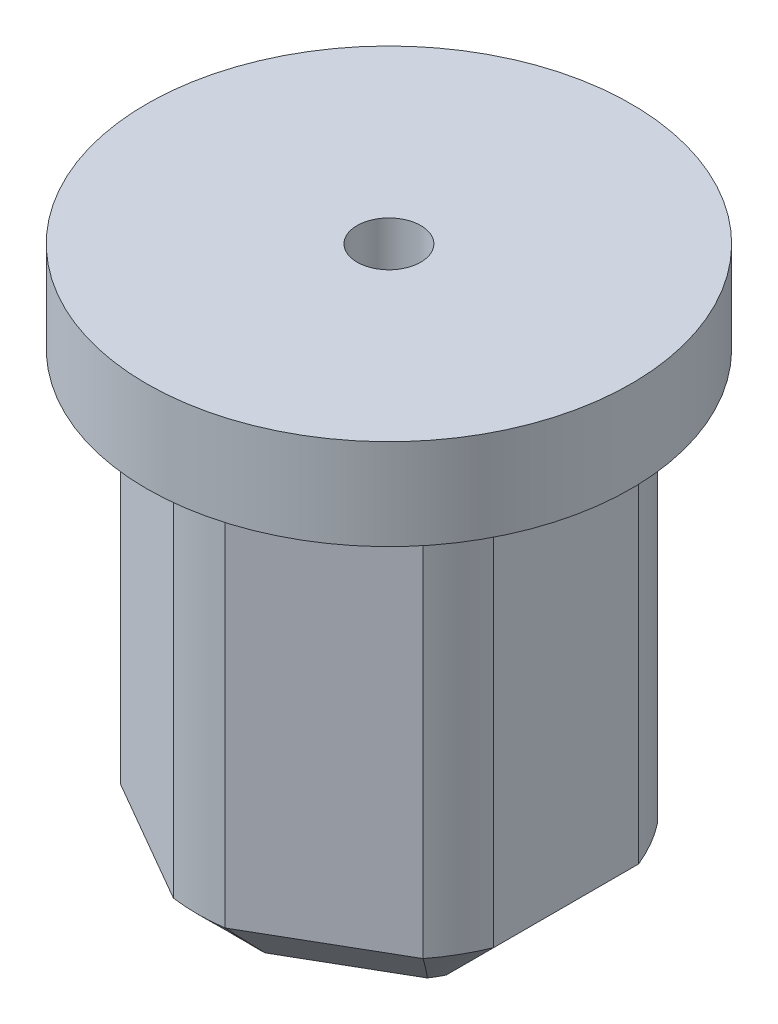
ISO-10303-21;
HEADER;
FILE_DESCRIPTION(('STEP AP214'),'2;1');
FILE_NAME('part.step','',(''),(''),'','','');
FILE_SCHEMA(('AUTOMOTIVE_DESIGN { 1 0 10303 214 1 1 1 1 }'));
ENDSEC;
DATA;
#1=APPLICATION_CONTEXT('core data for automotive mechanical design processes');
#2=APPLICATION_PROTOCOL_DEFINITION('international standard','automotive_design',2000,#1);
#3=PRODUCT_CONTEXT('',#1,'mechanical');
#4=PRODUCT('Part','Part','',(#3));
#5=PRODUCT_RELATED_PRODUCT_CATEGORY('part','',(#4));
#6=PRODUCT_DEFINITION_FORMATION('','',#4);
#7=PRODUCT_DEFINITION_CONTEXT('part definition',#1,'design');
#8=PRODUCT_DEFINITION('design','',#6,#7);
#9=PRODUCT_DEFINITION_SHAPE('','',#8);
#10=(LENGTH_UNIT() NAMED_UNIT(*) SI_UNIT(.MILLI.,.METRE.));
#11=(NAMED_UNIT(*) PLANE_ANGLE_UNIT() SI_UNIT($,.RADIAN.));
#12=(NAMED_UNIT(*) SI_UNIT($,.STERADIAN.) SOLID_ANGLE_UNIT());
#13=UNCERTAINTY_MEASURE_WITH_UNIT(LENGTH_MEASURE(1.E-05),#10,'distance_accuracy_value','');
#14=(GEOMETRIC_REPRESENTATION_CONTEXT(3) GLOBAL_UNCERTAINTY_ASSIGNED_CONTEXT((#13)) GLOBAL_UNIT_ASSIGNED_CONTEXT((#10,
#11,#12)) REPRESENTATION_CONTEXT('',''));
#15=CARTESIAN_POINT('',(0.,0.,0.));
#16=DIRECTION('',(0.,0.,1.));
#17=DIRECTION('',(1.,0.,0.));
#18=AXIS2_PLACEMENT_3D('',#15,#16,#17);
#19=CARTESIAN_POINT('',(0.,0.,0.));
#20=DIRECTION('',(0.,1.,0.));
#21=DIRECTION('',(0.,0.,1.));
#22=AXIS2_PLACEMENT_3D('',#19,#20,#21);
#23=PLANE('',#22);
#24=CARTESIAN_POINT('',(0.,0.,0.));
#25=DIRECTION('',(0.,1.,0.));
#26=DIRECTION('',(0.,0.,1.));
#27=AXIS2_PLACEMENT_3D('',#24,#25,#26);
#28=CIRCLE('',#27,8.);
#29=CARTESIAN_POINT('',(0.,0.,8.));
#30=VERTEX_POINT('',#29);
#31=EDGE_CURVE('E241',#30,#30,#28,.T.);
#32=ORIENTED_EDGE('',*,*,#31,.F.);
#33=EDGE_LOOP('',(#32));
#34=FACE_BOUND('',#33,.T.);
#35=DIRECTION('',(0.866025403784439,0.,0.5));
#36=VECTOR('',#35,1.);
#37=CARTESIAN_POINT('',(2.925,0.,-5.06624861213897));
#38=LINE('',#37,#36);
#39=CARTESIAN_POINT('',(0.853786587528944,0.,-6.26206423337829));
#40=VERTEX_POINT('',#39);
#41=CARTESIAN_POINT('',(4.99621341247106,0.,-3.87043299089964));
#42=VERTEX_POINT('',#41);
#43=EDGE_CURVE('E163',#40,#42,#38,.T.);
#44=ORIENTED_EDGE('',*,*,#43,.F.);
#45=CARTESIAN_POINT('',(0.,0.,0.));
#46=DIRECTION('',(0.,-1.,0.));
#47=DIRECTION('',(0.,0.,-1.));
#48=AXIS2_PLACEMENT_3D('',#45,#46,#47);
#49=CIRCLE('',#48,6.32);
#50=CARTESIAN_POINT('',(-0.853786587528945,0.,-6.26206423337829));
#51=VERTEX_POINT('',#50);
#52=EDGE_CURVE('E170',#51,#40,#49,.T.);
#53=ORIENTED_EDGE('',*,*,#52,.F.);
#54=DIRECTION('',(0.866025403784439,0.,-0.5));
#55=VECTOR('',#54,1.);
#56=CARTESIAN_POINT('',(-2.925,0.,-5.06624861213897));
#57=LINE('',#56,#55);
#58=CARTESIAN_POINT('',(-4.99621341247105,0.,-3.87043299089964));
#59=VERTEX_POINT('',#58);
#60=EDGE_CURVE('E184',#59,#51,#57,.T.);
#61=ORIENTED_EDGE('',*,*,#60,.F.);
#62=CARTESIAN_POINT('',(-5.85,0.,-2.39163124247866));
#63=VERTEX_POINT('',#62);
#64=EDGE_CURVE('E186',#63,#59,#49,.T.);
#65=ORIENTED_EDGE('',*,*,#64,.F.);
#66=DIRECTION('',(0.,0.,-1.));
#67=VECTOR('',#66,1.);
#68=CARTESIAN_POINT('',(-5.85,0.,0.));
#69=LINE('',#68,#67);
#70=CARTESIAN_POINT('',(-5.85,0.,2.39163124247866));
#71=VERTEX_POINT('',#70);
#72=EDGE_CURVE('E190',#71,#63,#69,.T.);
#73=ORIENTED_EDGE('',*,*,#72,.F.);
#74=CARTESIAN_POINT('',(-4.99621341247105,0.,3.87043299089964));
#75=VERTEX_POINT('',#74);
#76=EDGE_CURVE('E191',#75,#71,#49,.T.);
#77=ORIENTED_EDGE('',*,*,#76,.F.);
#78=DIRECTION('',(-0.866025403784439,0.,-0.5));
#79=VECTOR('',#78,1.);
#80=CARTESIAN_POINT('',(-2.925,0.,5.06624861213897));
#81=LINE('',#80,#79);
#82=CARTESIAN_POINT('',(-0.853786587528948,0.,6.26206423337829));
#83=VERTEX_POINT('',#82);
#84=EDGE_CURVE('E204',#83,#75,#81,.T.);
#85=ORIENTED_EDGE('',*,*,#84,.F.);
#86=CARTESIAN_POINT('',(0.853786587528945,0.,6.26206423337829));
#87=VERTEX_POINT('',#86);
#88=EDGE_CURVE('E197',#87,#83,#49,.T.);
#89=ORIENTED_EDGE('',*,*,#88,.F.);
#90=DIRECTION('',(-0.866025403784439,0.,0.5));
#91=VECTOR('',#90,1.);
#92=CARTESIAN_POINT('',(2.925,0.,5.06624861213897));
#93=LINE('',#92,#91);
#94=CARTESIAN_POINT('',(4.99621341247105,0.,3.87043299089964));
#95=VERTEX_POINT('',#94);
#96=EDGE_CURVE('E196',#95,#87,#93,.T.);
#97=ORIENTED_EDGE('',*,*,#96,.F.);
#98=CARTESIAN_POINT('',(5.85,0.,2.39163124247866));
#99=VERTEX_POINT('',#98);
#100=EDGE_CURVE('E193',#99,#95,#49,.T.);
#101=ORIENTED_EDGE('',*,*,#100,.F.);
#102=DIRECTION('',(0.,0.,1.));
#103=VECTOR('',#102,1.);
#104=CARTESIAN_POINT('',(5.85,0.,0.));
#105=LINE('',#104,#103);
#106=CARTESIAN_POINT('',(5.85,0.,-2.39163124247866));
#107=VERTEX_POINT('',#106);
#108=EDGE_CURVE('E192',#107,#99,#105,.T.);
#109=ORIENTED_EDGE('',*,*,#108,.F.);
#110=EDGE_CURVE('E179',#42,#107,#49,.T.);
#111=ORIENTED_EDGE('',*,*,#110,.F.);
#112=EDGE_LOOP('',(#44,#53,#61,#65,#73,#77,#85,#89,#97,#101,#109,#111));
#113=FACE_BOUND('',#112,.T.);
#114=ADVANCED_FACE('F33',(#34,#113),#23,.F.);
#115=CARTESIAN_POINT('',(0.,3.,0.));
#116=DIRECTION('',(0.,-1.,0.));
#117=DIRECTION('',(0.,0.,-1.));
#118=AXIS2_PLACEMENT_3D('',#115,#116,#117);
#119=CYLINDRICAL_SURFACE('',#118,8.);
#120=CARTESIAN_POINT('',(0.,3.,0.));
#121=DIRECTION('',(0.,1.,0.));
#122=DIRECTION('',(0.,0.,1.));
#123=AXIS2_PLACEMENT_3D('',#120,#121,#122);
#124=CIRCLE('',#123,8.);
#125=CARTESIAN_POINT('',(0.,3.,8.));
#126=VERTEX_POINT('',#125);
#127=EDGE_CURVE('E242',#126,#126,#124,.T.);
#128=ORIENTED_EDGE('',*,*,#127,.F.);
#129=EDGE_LOOP('',(#128));
#130=FACE_BOUND('',#129,.T.);
#131=ORIENTED_EDGE('',*,*,#31,.T.);
#132=EDGE_LOOP('',(#131));
#133=FACE_BOUND('',#132,.T.);
#134=ADVANCED_FACE('F486',(#130,#133),#119,.T.);
#135=CARTESIAN_POINT('',(0.,3.,0.));
#136=DIRECTION('',(0.,1.,0.));
#137=DIRECTION('',(0.,0.,1.));
#138=AXIS2_PLACEMENT_3D('',#135,#136,#137);
#139=PLANE('',#138);
#140=CARTESIAN_POINT('',(0.,3.,0.));
#141=DIRECTION('',(0.,1.,0.));
#142=DIRECTION('',(0.,0.,1.));
#143=AXIS2_PLACEMENT_3D('',#140,#141,#142);
#144=CIRCLE('',#143,1.04999999999999);
#145=CARTESIAN_POINT('',(0.,3.,1.04999999999999));
#146=VERTEX_POINT('',#145);
#147=EDGE_CURVE('E674',#146,#146,#144,.T.);
#148=ORIENTED_EDGE('',*,*,#147,.F.);
#149=EDGE_LOOP('',(#148));
#150=FACE_BOUND('',#149,.T.);
#151=ORIENTED_EDGE('',*,*,#127,.T.);
#152=EDGE_LOOP('',(#151));
#153=FACE_BOUND('',#152,.T.);
#154=ADVANCED_FACE('F478',(#150,#153),#139,.T.);
#155=CARTESIAN_POINT('',(2.925,-15.,-5.06624861213897));
#156=DIRECTION('',(-0.5,0.,0.866025403784439));
#157=DIRECTION('',(0.866025403784439,0.,0.5));
#158=AXIS2_PLACEMENT_3D('',#155,#156,#157);
#159=PLANE('',#158);
#160=DIRECTION('',(0.,1.,0.));
#161=VECTOR('',#160,1.);
#162=CARTESIAN_POINT('',(4.99621341247106,-15.,-3.87043299089964));
#163=LINE('',#162,#161);
#164=CARTESIAN_POINT('',(4.99621341247106,-13.,-3.87043299089964));
#165=VERTEX_POINT('',#164);
#166=EDGE_CURVE('E239',#165,#42,#163,.T.);
#167=ORIENTED_EDGE('',*,*,#166,.F.);
#168=DIRECTION('',(-0.866025403784439,0.,-0.5));
#169=VECTOR('',#168,1.);
#170=CARTESIAN_POINT('',(0.853786587528944,-13.,-6.26206423337829));
#171=LINE('',#170,#169);
#172=CARTESIAN_POINT('',(0.853786587528944,-13.,-6.26206423337829));
#173=VERTEX_POINT('',#172);
#174=EDGE_CURVE('E11',#165,#173,#171,.T.);
#175=ORIENTED_EDGE('',*,*,#174,.T.);
#176=DIRECTION('',(0.,1.,0.));
#177=VECTOR('',#176,1.);
#178=CARTESIAN_POINT('',(0.853786587528944,-15.,-6.26206423337829));
#179=LINE('',#178,#177);
#180=EDGE_CURVE('E160',#173,#40,#179,.T.);
#181=ORIENTED_EDGE('',*,*,#180,.T.);
#182=ORIENTED_EDGE('',*,*,#43,.T.);
#183=EDGE_LOOP('',(#167,#175,#181,#182));
#184=FACE_BOUND('',#183,.T.);
#185=ADVANCED_FACE('F162',(#184),#159,.F.);
#186=CARTESIAN_POINT('',(0.,-15.,0.));
#187=DIRECTION('',(0.,1.,0.));
#188=DIRECTION('',(0.,0.,1.));
#189=AXIS2_PLACEMENT_3D('',#186,#187,#188);
#190=CYLINDRICAL_SURFACE('',#189,6.32);
#191=DIRECTION('',(0.,1.,0.));
#192=VECTOR('',#191,1.);
#193=CARTESIAN_POINT('',(5.85,-15.,-2.39163124247866));
#194=LINE('',#193,#192);
#195=CARTESIAN_POINT('',(5.85,-13.,-2.39163124247866));
#196=VERTEX_POINT('',#195);
#197=EDGE_CURVE('E237',#196,#107,#194,.T.);
#198=ORIENTED_EDGE('',*,*,#197,.F.);
#199=CARTESIAN_POINT('',(0.,-13.,0.));
#200=DIRECTION('',(0.,-1.,0.));
#201=DIRECTION('',(0.,0.,-1.));
#202=AXIS2_PLACEMENT_3D('',#199,#200,#201);
#203=CIRCLE('',#202,6.32);
#204=EDGE_CURVE('E43',#196,#165,#203,.F.);
#205=ORIENTED_EDGE('',*,*,#204,.T.);
#206=ORIENTED_EDGE('',*,*,#166,.T.);
#207=ORIENTED_EDGE('',*,*,#110,.T.);
#208=EDGE_LOOP('',(#198,#205,#206,#207));
#209=FACE_BOUND('',#208,.T.);
#210=ADVANCED_FACE('F470',(#209),#190,.T.);
#211=CARTESIAN_POINT('',(5.85,-15.,0.));
#212=DIRECTION('',(-1.,0.,0.));
#213=DIRECTION('',(0.,0.,1.));
#214=AXIS2_PLACEMENT_3D('',#211,#212,#213);
#215=PLANE('',#214);
#216=DIRECTION('',(0.,1.,0.));
#217=VECTOR('',#216,1.);
#218=CARTESIAN_POINT('',(5.85,-15.,2.39163124247866));
#219=LINE('',#218,#217);
#220=CARTESIAN_POINT('',(5.85,-13.,2.39163124247866));
#221=VERTEX_POINT('',#220);
#222=EDGE_CURVE('E235',#221,#99,#219,.T.);
#223=ORIENTED_EDGE('',*,*,#222,.F.);
#224=DIRECTION('',(0.,0.,-1.));
#225=VECTOR('',#224,1.);
#226=CARTESIAN_POINT('',(5.85,-13.,-2.39163124247866));
#227=LINE('',#226,#225);
#228=EDGE_CURVE('E58',#221,#196,#227,.T.);
#229=ORIENTED_EDGE('',*,*,#228,.T.);
#230=ORIENTED_EDGE('',*,*,#197,.T.);
#231=ORIENTED_EDGE('',*,*,#108,.T.);
#232=EDGE_LOOP('',(#223,#229,#230,#231));
#233=FACE_BOUND('',#232,.T.);
#234=ADVANCED_FACE('F469',(#233),#215,.F.);
#235=DIRECTION('',(0.,1.,0.));
#236=VECTOR('',#235,1.);
#237=CARTESIAN_POINT('',(4.99621341247105,-15.,3.87043299089964));
#238=LINE('',#237,#236);
#239=CARTESIAN_POINT('',(4.99621341247105,-13.,3.87043299089964));
#240=VERTEX_POINT('',#239);
#241=EDGE_CURVE('E233',#240,#95,#238,.T.);
#242=ORIENTED_EDGE('',*,*,#241,.F.);
#243=CARTESIAN_POINT('',(0.,-13.,0.));
#244=DIRECTION('',(0.,-1.,0.));
#245=DIRECTION('',(0.,0.,-1.));
#246=AXIS2_PLACEMENT_3D('',#243,#244,#245);
#247=CIRCLE('',#246,6.32);
#248=EDGE_CURVE('E288',#240,#221,#247,.F.);
#249=ORIENTED_EDGE('',*,*,#248,.T.);
#250=ORIENTED_EDGE('',*,*,#222,.T.);
#251=ORIENTED_EDGE('',*,*,#100,.T.);
#252=EDGE_LOOP('',(#242,#249,#250,#251));
#253=FACE_BOUND('',#252,.T.);
#254=ADVANCED_FACE('F468',(#253),#190,.T.);
#255=CARTESIAN_POINT('',(2.925,-15.,5.06624861213897));
#256=DIRECTION('',(-0.5,0.,-0.866025403784439));
#257=DIRECTION('',(-0.866025403784439,0.,0.5));
#258=AXIS2_PLACEMENT_3D('',#255,#256,#257);
#259=PLANE('',#258);
#260=DIRECTION('',(0.,1.,0.));
#261=VECTOR('',#260,1.);
#262=CARTESIAN_POINT('',(0.853786587528945,-15.,6.26206423337829));
#263=LINE('',#262,#261);
#264=CARTESIAN_POINT('',(0.853786587528945,-13.,6.26206423337829));
#265=VERTEX_POINT('',#264);
#266=EDGE_CURVE('E231',#265,#87,#263,.T.);
#267=ORIENTED_EDGE('',*,*,#266,.F.);
#268=DIRECTION('',(0.866025403784439,0.,-0.5));
#269=VECTOR('',#268,1.);
#270=CARTESIAN_POINT('',(4.99621341247105,-13.,3.87043299089964));
#271=LINE('',#270,#269);
#272=EDGE_CURVE('E286',#265,#240,#271,.T.);
#273=ORIENTED_EDGE('',*,*,#272,.T.);
#274=ORIENTED_EDGE('',*,*,#241,.T.);
#275=ORIENTED_EDGE('',*,*,#96,.T.);
#276=EDGE_LOOP('',(#267,#273,#274,#275));
#277=FACE_BOUND('',#276,.T.);
#278=ADVANCED_FACE('F467',(#277),#259,.F.);
#279=DIRECTION('',(0.,1.,0.));
#280=VECTOR('',#279,1.);
#281=CARTESIAN_POINT('',(-0.853786587528948,-15.,6.26206423337829));
#282=LINE('',#281,#280);
#283=CARTESIAN_POINT('',(-0.853786587528948,-13.,6.26206423337829));
#284=VERTEX_POINT('',#283);
#285=EDGE_CURVE('E229',#284,#83,#282,.T.);
#286=ORIENTED_EDGE('',*,*,#285,.F.);
#287=CARTESIAN_POINT('',(0.,-13.,0.));
#288=DIRECTION('',(0.,-1.,0.));
#289=DIRECTION('',(0.,0.,-1.));
#290=AXIS2_PLACEMENT_3D('',#287,#288,#289);
#291=CIRCLE('',#290,6.32);
#292=EDGE_CURVE('E284',#284,#265,#291,.F.);
#293=ORIENTED_EDGE('',*,*,#292,.T.);
#294=ORIENTED_EDGE('',*,*,#266,.T.);
#295=ORIENTED_EDGE('',*,*,#88,.T.);
#296=EDGE_LOOP('',(#286,#293,#294,#295));
#297=FACE_BOUND('',#296,.T.);
#298=ADVANCED_FACE('F483',(#297),#190,.T.);
#299=CARTESIAN_POINT('',(-2.925,-15.,5.06624861213897));
#300=DIRECTION('',(0.5,0.,-0.866025403784439));
#301=DIRECTION('',(-0.866025403784439,0.,-0.5));
#302=AXIS2_PLACEMENT_3D('',#299,#300,#301);
#303=PLANE('',#302);
#304=DIRECTION('',(0.,1.,0.));
#305=VECTOR('',#304,1.);
#306=CARTESIAN_POINT('',(-4.99621341247105,-15.,3.87043299089964));
#307=LINE('',#306,#305);
#308=CARTESIAN_POINT('',(-4.99621341247105,-13.,3.87043299089964));
#309=VERTEX_POINT('',#308);
#310=EDGE_CURVE('E227',#309,#75,#307,.T.);
#311=ORIENTED_EDGE('',*,*,#310,.F.);
#312=DIRECTION('',(0.866025403784439,0.,0.5));
#313=VECTOR('',#312,1.);
#314=CARTESIAN_POINT('',(-0.853786587528949,-13.,6.26206423337829));
#315=LINE('',#314,#313);
#316=EDGE_CURVE('E282',#309,#284,#315,.T.);
#317=ORIENTED_EDGE('',*,*,#316,.T.);
#318=ORIENTED_EDGE('',*,*,#285,.T.);
#319=ORIENTED_EDGE('',*,*,#84,.T.);
#320=EDGE_LOOP('',(#311,#317,#318,#319));
#321=FACE_BOUND('',#320,.T.);
#322=ADVANCED_FACE('F462',(#321),#303,.F.);
#323=DIRECTION('',(0.,1.,0.));
#324=VECTOR('',#323,1.);
#325=CARTESIAN_POINT('',(-5.85,-15.,2.39163124247866));
#326=LINE('',#325,#324);
#327=CARTESIAN_POINT('',(-5.85,-13.,2.39163124247866));
#328=VERTEX_POINT('',#327);
#329=EDGE_CURVE('E225',#328,#71,#326,.T.);
#330=ORIENTED_EDGE('',*,*,#329,.F.);
#331=CARTESIAN_POINT('',(0.,-13.,0.));
#332=DIRECTION('',(0.,-1.,0.));
#333=DIRECTION('',(0.,0.,-1.));
#334=AXIS2_PLACEMENT_3D('',#331,#332,#333);
#335=CIRCLE('',#334,6.32);
#336=EDGE_CURVE('E280',#328,#309,#335,.F.);
#337=ORIENTED_EDGE('',*,*,#336,.T.);
#338=ORIENTED_EDGE('',*,*,#310,.T.);
#339=ORIENTED_EDGE('',*,*,#76,.T.);
#340=EDGE_LOOP('',(#330,#337,#338,#339));
#341=FACE_BOUND('',#340,.T.);
#342=ADVANCED_FACE('F460',(#341),#190,.T.);
#343=CARTESIAN_POINT('',(-5.85,-15.,0.));
#344=DIRECTION('',(1.,0.,0.));
#345=DIRECTION('',(0.,0.,-1.));
#346=AXIS2_PLACEMENT_3D('',#343,#344,#345);
#347=PLANE('',#346);
#348=DIRECTION('',(0.,1.,0.));
#349=VECTOR('',#348,1.);
#350=CARTESIAN_POINT('',(-5.85,-15.,-2.39163124247866));
#351=LINE('',#350,#349);
#352=CARTESIAN_POINT('',(-5.85,-13.,-2.39163124247866));
#353=VERTEX_POINT('',#352);
#354=EDGE_CURVE('E223',#353,#63,#351,.T.);
#355=ORIENTED_EDGE('',*,*,#354,.F.);
#356=DIRECTION('',(0.,0.,1.));
#357=VECTOR('',#356,1.);
#358=CARTESIAN_POINT('',(-5.85,-13.,2.39163124247866));
#359=LINE('',#358,#357);
#360=EDGE_CURVE('E278',#353,#328,#359,.T.);
#361=ORIENTED_EDGE('',*,*,#360,.T.);
#362=ORIENTED_EDGE('',*,*,#329,.T.);
#363=ORIENTED_EDGE('',*,*,#72,.T.);
#364=EDGE_LOOP('',(#355,#361,#362,#363));
#365=FACE_BOUND('',#364,.T.);
#366=ADVANCED_FACE('F450',(#365),#347,.F.);
#367=DIRECTION('',(0.,1.,0.));
#368=VECTOR('',#367,1.);
#369=CARTESIAN_POINT('',(-4.99621341247105,-15.,-3.87043299089964));
#370=LINE('',#369,#368);
#371=CARTESIAN_POINT('',(-4.99621341247105,-13.,-3.87043299089964));
#372=VERTEX_POINT('',#371);
#373=EDGE_CURVE('E221',#372,#59,#370,.T.);
#374=ORIENTED_EDGE('',*,*,#373,.F.);
#375=CARTESIAN_POINT('',(0.,-13.,0.));
#376=DIRECTION('',(0.,-1.,0.));
#377=DIRECTION('',(0.,0.,-1.));
#378=AXIS2_PLACEMENT_3D('',#375,#376,#377);
#379=CIRCLE('',#378,6.32);
#380=EDGE_CURVE('E276',#372,#353,#379,.F.);
#381=ORIENTED_EDGE('',*,*,#380,.T.);
#382=ORIENTED_EDGE('',*,*,#354,.T.);
#383=ORIENTED_EDGE('',*,*,#64,.T.);
#384=EDGE_LOOP('',(#374,#381,#382,#383));
#385=FACE_BOUND('',#384,.T.);
#386=ADVANCED_FACE('F447',(#385),#190,.T.);
#387=CARTESIAN_POINT('',(-2.925,-15.,-5.06624861213897));
#388=DIRECTION('',(0.5,0.,0.866025403784439));
#389=DIRECTION('',(0.866025403784439,0.,-0.5));
#390=AXIS2_PLACEMENT_3D('',#387,#388,#389);
#391=PLANE('',#390);
#392=DIRECTION('',(0.,1.,0.));
#393=VECTOR('',#392,1.);
#394=CARTESIAN_POINT('',(-0.853786587528945,-15.,-6.26206423337829));
#395=LINE('',#394,#393);
#396=CARTESIAN_POINT('',(-0.853786587528945,-13.,-6.26206423337829));
#397=VERTEX_POINT('',#396);
#398=EDGE_CURVE('E169',#397,#51,#395,.T.);
#399=ORIENTED_EDGE('',*,*,#398,.F.);
#400=DIRECTION('',(-0.866025403784439,0.,0.5));
#401=VECTOR('',#400,1.);
#402=CARTESIAN_POINT('',(-4.99621341247105,-13.,-3.87043299089964));
#403=LINE('',#402,#401);
#404=EDGE_CURVE('E274',#397,#372,#403,.T.);
#405=ORIENTED_EDGE('',*,*,#404,.T.);
#406=ORIENTED_EDGE('',*,*,#373,.T.);
#407=ORIENTED_EDGE('',*,*,#60,.T.);
#408=EDGE_LOOP('',(#399,#405,#406,#407));
#409=FACE_BOUND('',#408,.T.);
#410=ADVANCED_FACE('F443',(#409),#391,.F.);
#411=ORIENTED_EDGE('',*,*,#180,.F.);
#412=CARTESIAN_POINT('',(0.,-13.,0.));
#413=DIRECTION('',(0.,-1.,0.));
#414=DIRECTION('',(0.,0.,-1.));
#415=AXIS2_PLACEMENT_3D('',#412,#413,#414);
#416=CIRCLE('',#415,6.32);
#417=EDGE_CURVE('E272',#173,#397,#416,.F.);
#418=ORIENTED_EDGE('',*,*,#417,.T.);
#419=ORIENTED_EDGE('',*,*,#398,.T.);
#420=ORIENTED_EDGE('',*,*,#52,.T.);
#421=EDGE_LOOP('',(#411,#418,#419,#420));
#422=FACE_BOUND('',#421,.T.);
#423=ADVANCED_FACE('F182',(#422),#190,.T.);
#424=CARTESIAN_POINT('',(0.,-15.,0.));
#425=DIRECTION('',(0.,-1.,0.));
#426=DIRECTION('',(0.,0.,-1.));
#427=AXIS2_PLACEMENT_3D('',#424,#425,#426);
#428=PLANE('',#427);
#429=CARTESIAN_POINT('',(0.,-15.,0.));
#430=DIRECTION('',(0.,-1.,0.));
#431=DIRECTION('',(0.,0.,-1.));
#432=AXIS2_PLACEMENT_3D('',#429,#430,#431);
#433=CIRCLE('',#432,2.5);
#434=CARTESIAN_POINT('',(0.,-15.,-2.5));
#435=VERTEX_POINT('',#434);
#436=EDGE_CURVE('E677',#435,#435,#433,.T.);
#437=ORIENTED_EDGE('',*,*,#436,.F.);
#438=EDGE_LOOP('',(#437));
#439=FACE_BOUND('',#438,.T.);
#440=DIRECTION('',(0.866025403784439,0.,-0.5));
#441=VECTOR('',#440,1.);
#442=CARTESIAN_POINT('',(0.146213412471054,-15.,-4.53001342580942));
#443=LINE('',#442,#441);
#444=CARTESIAN_POINT('',(-3.62203417761694,-15.,-2.35441466529896));
#445=VERTEX_POINT('',#444);
#446=CARTESIAN_POINT('',(-0.227965822383059,-15.,-4.31398094384123));
#447=VERTEX_POINT('',#446);
#448=EDGE_CURVE('E267',#445,#447,#443,.T.);
#449=ORIENTED_EDGE('',*,*,#448,.T.);
#450=CARTESIAN_POINT('',(0.,-15.,0.));
#451=DIRECTION('',(0.,-1.,0.));
#452=DIRECTION('',(0.,0.,-1.));
#453=AXIS2_PLACEMENT_3D('',#450,#451,#452);
#454=CIRCLE('',#453,4.32);
#455=CARTESIAN_POINT('',(0.227965822383062,-15.,-4.31398094384123));
#456=VERTEX_POINT('',#455);
#457=EDGE_CURVE('E269',#447,#456,#454,.T.);
#458=ORIENTED_EDGE('',*,*,#457,.T.);
#459=DIRECTION('',(0.866025403784439,0.,0.5));
#460=VECTOR('',#459,1.);
#461=CARTESIAN_POINT('',(3.99621341247106,-15.,-2.13838218333076));
#462=LINE('',#461,#460);
#463=CARTESIAN_POINT('',(3.62203417761694,-15.,-2.35441466529895));
#464=VERTEX_POINT('',#463);
#465=EDGE_CURVE('E245',#456,#464,#462,.T.);
#466=ORIENTED_EDGE('',*,*,#465,.T.);
#467=CARTESIAN_POINT('',(0.,-15.,0.));
#468=DIRECTION('',(0.,-1.,0.));
#469=DIRECTION('',(0.,0.,-1.));
#470=AXIS2_PLACEMENT_3D('',#467,#468,#469);
#471=CIRCLE('',#470,4.32);
#472=CARTESIAN_POINT('',(3.85,-15.,-1.95956627854227));
#473=VERTEX_POINT('',#472);
#474=EDGE_CURVE('E249',#464,#473,#471,.T.);
#475=ORIENTED_EDGE('',*,*,#474,.T.);
#476=DIRECTION('',(0.,0.,1.));
#477=VECTOR('',#476,1.);
#478=CARTESIAN_POINT('',(3.85,-15.,2.39163124247866));
#479=LINE('',#478,#477);
#480=CARTESIAN_POINT('',(3.85,-15.,1.95956627854228));
#481=VERTEX_POINT('',#480);
#482=EDGE_CURVE('E251',#473,#481,#479,.T.);
#483=ORIENTED_EDGE('',*,*,#482,.T.);
#484=CARTESIAN_POINT('',(0.,-15.,0.));
#485=DIRECTION('',(0.,-1.,0.));
#486=DIRECTION('',(0.,0.,-1.));
#487=AXIS2_PLACEMENT_3D('',#484,#485,#486);
#488=CIRCLE('',#487,4.32);
#489=CARTESIAN_POINT('',(3.62203417761694,-15.,2.35441466529896));
#490=VERTEX_POINT('',#489);
#491=EDGE_CURVE('E253',#481,#490,#488,.T.);
#492=ORIENTED_EDGE('',*,*,#491,.T.);
#493=DIRECTION('',(-0.866025403784439,0.,0.5));
#494=VECTOR('',#493,1.);
#495=CARTESIAN_POINT('',(-0.146213412471054,-15.,4.53001342580942));
#496=LINE('',#495,#494);
#497=CARTESIAN_POINT('',(0.22796582238306,-15.,4.31398094384123));
#498=VERTEX_POINT('',#497);
#499=EDGE_CURVE('E255',#490,#498,#496,.T.);
#500=ORIENTED_EDGE('',*,*,#499,.T.);
#501=CARTESIAN_POINT('',(0.,-15.,0.));
#502=DIRECTION('',(0.,-1.,0.));
#503=DIRECTION('',(0.,0.,-1.));
#504=AXIS2_PLACEMENT_3D('',#501,#502,#503);
#505=CIRCLE('',#504,4.32);
#506=CARTESIAN_POINT('',(-0.227965822383068,-15.,4.31398094384123));
#507=VERTEX_POINT('',#506);
#508=EDGE_CURVE('E257',#498,#507,#505,.T.);
#509=ORIENTED_EDGE('',*,*,#508,.T.);
#510=DIRECTION('',(-0.866025403784439,0.,-0.5));
#511=VECTOR('',#510,1.);
#512=CARTESIAN_POINT('',(-3.99621341247106,-15.,2.13838218333077));
#513=LINE('',#512,#511);
#514=CARTESIAN_POINT('',(-3.62203417761694,-15.,2.35441466529896));
#515=VERTEX_POINT('',#514);
#516=EDGE_CURVE('E259',#507,#515,#513,.T.);
#517=ORIENTED_EDGE('',*,*,#516,.T.);
#518=CARTESIAN_POINT('',(0.,-15.,0.));
#519=DIRECTION('',(0.,-1.,0.));
#520=DIRECTION('',(0.,0.,-1.));
#521=AXIS2_PLACEMENT_3D('',#518,#519,#520);
#522=CIRCLE('',#521,4.32);
#523=CARTESIAN_POINT('',(-3.85,-15.,1.95956627854227));
#524=VERTEX_POINT('',#523);
#525=EDGE_CURVE('E261',#515,#524,#522,.T.);
#526=ORIENTED_EDGE('',*,*,#525,.T.);
#527=DIRECTION('',(0.,0.,-1.));
#528=VECTOR('',#527,1.);
#529=CARTESIAN_POINT('',(-3.85,-15.,-2.39163124247866));
#530=LINE('',#529,#528);
#531=CARTESIAN_POINT('',(-3.85,-15.,-1.95956627854227));
#532=VERTEX_POINT('',#531);
#533=EDGE_CURVE('E263',#524,#532,#530,.T.);
#534=ORIENTED_EDGE('',*,*,#533,.T.);
#535=CARTESIAN_POINT('',(0.,-15.,0.));
#536=DIRECTION('',(0.,-1.,0.));
#537=DIRECTION('',(0.,0.,-1.));
#538=AXIS2_PLACEMENT_3D('',#535,#536,#537);
#539=CIRCLE('',#538,4.32);
#540=EDGE_CURVE('E265',#532,#445,#539,.T.);
#541=ORIENTED_EDGE('',*,*,#540,.T.);
#542=EDGE_LOOP('',(#449,#458,#466,#475,#483,#492,#500,#509,#517,#526,#534,#541));
#543=FACE_BOUND('',#542,.T.);
#544=ADVANCED_FACE('F421',(#439,#543),#428,.T.);
#545=CARTESIAN_POINT('',(0.,-15.,0.));
#546=DIRECTION('',(0.,1.,0.));
#547=DIRECTION('',(0.,0.,1.));
#548=AXIS2_PLACEMENT_3D('',#545,#546,#547);
#549=CONICAL_SURFACE('',#548,4.32,0.785398163397446);
#550=CARTESIAN_POINT('',(0.853786587528945,-13.,6.26206423337829));
#551=CARTESIAN_POINT('',(0.798713202197299,-13.1670028504663,6.10102258588045));
#552=CARTESIAN_POINT('',(0.744234082561959,-13.3339427147389,5.93971056911455));
#553=CARTESIAN_POINT('',(0.636660548562186,-13.6676586538454,5.61647620337499));
#554=CARTESIAN_POINT('',(0.583566058500014,-13.8344347371514,5.45455388832261));
#555=CARTESIAN_POINT('',(0.478950596144914,-14.1678076957913,5.1300077188522));
#556=CARTESIAN_POINT('',(0.427429662528861,-14.3344045666232,4.96738384730236));
#557=CARTESIAN_POINT('',(0.326238851507311,-14.6673796797789,4.64131984685742));
#558=CARTESIAN_POINT('',(0.276569075992857,-14.8337579095834,4.47787967359145));
#559=CARTESIAN_POINT('',(0.227965822383061,-15.,4.31398094384123));
#560=B_SPLINE_CURVE_WITH_KNOTS('',3,(#550,#551,#552,#553,#554,#555,#556,#557,#558,#559),
.UNSPECIFIED.,.F.,.F.,(4,2,2,2,4),(0.,0.715344790162214,1.43065039006989,2.14597355754313,
2.86133603970507),.UNSPECIFIED.);
#561=EDGE_CURVE('E394',#265,#498,#560,.T.);
#562=ORIENTED_EDGE('',*,*,#561,.F.);
#563=ORIENTED_EDGE('',*,*,#292,.F.);
#564=CARTESIAN_POINT('',(-0.853786587528948,-13.,6.26206423337829));
#565=CARTESIAN_POINT('',(-0.798713202197304,-13.1670028504663,6.10102258588045));
#566=CARTESIAN_POINT('',(-0.744234082561965,-13.3339427147389,5.93971056911455));
#567=CARTESIAN_POINT('',(-0.636660548562192,-13.6676586538454,5.61647620337499));
#568=CARTESIAN_POINT('',(-0.583566058500019,-13.8344347371514,5.45455388832261));
#569=CARTESIAN_POINT('',(-0.478950596144919,-14.1678076957913,5.1300077188522));
#570=CARTESIAN_POINT('',(-0.427429662528865,-14.3344045666232,4.96738384730236));
#571=CARTESIAN_POINT('',(-0.326238851507315,-14.6673796797789,4.64131984685742));
#572=CARTESIAN_POINT('',(-0.276569075992861,-14.8337579095834,4.47787967359145));
#573=CARTESIAN_POINT('',(-0.227965822383066,-15.,4.31398094384123));
#574=B_SPLINE_CURVE_WITH_KNOTS('',3,(#564,#565,#566,#567,#568,#569,#570,#571,#572,#573),
.UNSPECIFIED.,.F.,.F.,(4,2,2,2,4),(0.,0.715344790162213,1.43065039006989,2.14597355754313,
2.86133603970507),.UNSPECIFIED.);
#575=EDGE_CURVE('E180',#507,#284,#574,.F.);
#576=ORIENTED_EDGE('',*,*,#575,.F.);
#577=ORIENTED_EDGE('',*,*,#508,.F.);
#578=EDGE_LOOP('',(#562,#563,#576,#577));
#579=FACE_BOUND('',#578,.T.);
#580=ADVANCED_FACE('F35',(#579),#549,.T.);
#581=CARTESIAN_POINT('',(-1.925,-15.,3.33419780457009));
#582=DIRECTION('',(-0.353553390593275,-0.707106781186546,0.612372435695796));
#583=DIRECTION('',(0.866025403784439,0.,0.5));
#584=AXIS2_PLACEMENT_3D('',#581,#582,#583);
#585=PLANE('',#584);
#586=ORIENTED_EDGE('',*,*,#575,.T.);
#587=ORIENTED_EDGE('',*,*,#316,.F.);
#588=CARTESIAN_POINT('',(-4.99621341247105,-13.,3.87043299089964));
#589=CARTESIAN_POINT('',(-4.88428394733644,-13.1670028504663,3.7422172163811));
#590=CARTESIAN_POINT('',(-4.77182320269914,-13.3339427147389,3.61438090641814));
#591=CARTESIAN_POINT('',(-4.54568079759242,-13.6676586538454,3.35960231032968));
#592=CARTESIAN_POINT('',(-4.43199920434856,-13.8344347371514,3.23265997560868));
#593=CARTESIAN_POINT('',(-4.2032417080638,-14.1678076957913,2.9797872428453));
#594=CARTESIAN_POINT('',(-4.08816577084789,-14.3344045666232,2.85385686973218));
#595=CARTESIAN_POINT('',(-3.85638146871376,-14.6673796797789,2.6031910565355));
#596=CARTESIAN_POINT('',(-3.73967301442373,-14.8337579095834,2.47845568250673));
#597=CARTESIAN_POINT('',(-3.62203417761694,-15.,2.35441466529896));
#598=B_SPLINE_CURVE_WITH_KNOTS('',3,(#588,#589,#590,#591,#592,#593,#594,#595,#596,#597),
.UNSPECIFIED.,.F.,.F.,(4,2,2,2,4),(0.,0.715344790162216,1.4306503900699,2.14597355754313,
2.86133603970507),.UNSPECIFIED.);
#599=EDGE_CURVE('E388',#515,#309,#598,.F.);
#600=ORIENTED_EDGE('',*,*,#599,.F.);
#601=ORIENTED_EDGE('',*,*,#516,.F.);
#602=EDGE_LOOP('',(#586,#587,#600,#601));
#603=FACE_BOUND('',#602,.T.);
#604=ADVANCED_FACE('F398',(#603),#585,.T.);
#605=CARTESIAN_POINT('',(1.925,-15.,3.33419780457009));
#606=DIRECTION('',(0.353553390593274,-0.707106781186546,0.612372435695796));
#607=DIRECTION('',(0.866025403784439,0.,-0.5));
#608=AXIS2_PLACEMENT_3D('',#605,#606,#607);
#609=PLANE('',#608);
#610=ORIENTED_EDGE('',*,*,#561,.T.);
#611=ORIENTED_EDGE('',*,*,#499,.F.);
#612=CARTESIAN_POINT('',(4.99621341247105,-13.,3.87043299089964));
#613=CARTESIAN_POINT('',(4.88428394733644,-13.1670028504663,3.74221721638111));
#614=CARTESIAN_POINT('',(4.77182320269914,-13.3339427147389,3.61438090641814));
#615=CARTESIAN_POINT('',(4.54568079759242,-13.6676586538454,3.35960231032968));
#616=CARTESIAN_POINT('',(4.43199920434856,-13.8344347371514,3.23265997560867));
#617=CARTESIAN_POINT('',(4.20324170806381,-14.1678076957913,2.9797872428453));
#618=CARTESIAN_POINT('',(4.08816577084789,-14.3344045666232,2.85385686973218));
#619=CARTESIAN_POINT('',(3.85638146871377,-14.6673796797789,2.6031910565355));
#620=CARTESIAN_POINT('',(3.73967301442373,-14.8337579095834,2.47845568250673));
#621=CARTESIAN_POINT('',(3.62203417761694,-15.,2.35441466529896));
#622=B_SPLINE_CURVE_WITH_KNOTS('',3,(#612,#613,#614,#615,#616,#617,#618,#619,#620,#621),
.UNSPECIFIED.,.F.,.F.,(4,2,2,2,4),(0.,0.715344790162214,1.43065039006989,2.14597355754313,
2.86133603970507),.UNSPECIFIED.);
#623=EDGE_CURVE('E375',#240,#490,#622,.T.);
#624=ORIENTED_EDGE('',*,*,#623,.F.);
#625=ORIENTED_EDGE('',*,*,#272,.F.);
#626=EDGE_LOOP('',(#610,#611,#624,#625));
#627=FACE_BOUND('',#626,.T.);
#628=ADVANCED_FACE('F384',(#627),#609,.T.);
#629=CARTESIAN_POINT('',(0.,-15.,0.));
#630=DIRECTION('',(0.,1.,0.));
#631=DIRECTION('',(0.,0.,1.));
#632=AXIS2_PLACEMENT_3D('',#629,#630,#631);
#633=CONICAL_SURFACE('',#632,4.32,0.785398163397446);
#634=ORIENTED_EDGE('',*,*,#599,.T.);
#635=ORIENTED_EDGE('',*,*,#336,.F.);
#636=CARTESIAN_POINT('',(-5.85,-13.,2.39163124247866));
#637=CARTESIAN_POINT('',(-5.68299714953374,-13.1670028504663,2.35880536949935));
#638=CARTESIAN_POINT('',(-5.51605728526111,-13.3339427147389,2.32532966269641));
#639=CARTESIAN_POINT('',(-5.1823413461546,-13.6676586538454,2.2568738930453));
#640=CARTESIAN_POINT('',(-5.01556526284858,-13.8344347371514,2.22189391271394));
#641=CARTESIAN_POINT('',(-4.68219230420872,-14.1678076957913,2.15022047600691));
#642=CARTESIAN_POINT('',(-4.51559543337675,-14.3344045666232,2.11352697757018));
#643=CARTESIAN_POINT('',(-4.18262032022108,-14.6673796797789,2.03812879032192));
#644=CARTESIAN_POINT('',(-4.01624209041659,-14.8337579095834,1.99942399108472));
#645=CARTESIAN_POINT('',(-3.85,-15.,1.95956627854227));
#646=B_SPLINE_CURVE_WITH_KNOTS('',3,(#636,#637,#638,#639,#640,#641,#642,#643,#644,#645),
.UNSPECIFIED.,.F.,.F.,(4,2,2,2,4),(0.,0.715344790162214,1.43065039006989,2.14597355754313,
2.86133603970507),.UNSPECIFIED.);
#647=EDGE_CURVE('E369',#524,#328,#646,.F.);
#648=ORIENTED_EDGE('',*,*,#647,.F.);
#649=ORIENTED_EDGE('',*,*,#525,.F.);
#650=EDGE_LOOP('',(#634,#635,#648,#649));
#651=FACE_BOUND('',#650,.T.);
#652=ADVANCED_FACE('F381',(#651),#633,.T.);
#653=CARTESIAN_POINT('',(0.,-15.,0.));
#654=DIRECTION('',(0.,1.,0.));
#655=DIRECTION('',(0.,0.,1.));
#656=AXIS2_PLACEMENT_3D('',#653,#654,#655);
#657=CONICAL_SURFACE('',#656,4.32,0.785398163397446);
#658=ORIENTED_EDGE('',*,*,#623,.T.);
#659=ORIENTED_EDGE('',*,*,#491,.F.);
#660=CARTESIAN_POINT('',(5.85,-13.,2.39163124247866));
#661=CARTESIAN_POINT('',(5.68299714953374,-13.1670028504663,2.35880536949936));
#662=CARTESIAN_POINT('',(5.5160572852611,-13.3339427147389,2.32532966269642));
#663=CARTESIAN_POINT('',(5.1823413461546,-13.6676586538454,2.25687389304531));
#664=CARTESIAN_POINT('',(5.01556526284857,-13.8344347371514,2.22189391271394));
#665=CARTESIAN_POINT('',(4.68219230420872,-14.1678076957913,2.15022047600691));
#666=CARTESIAN_POINT('',(4.51559543337675,-14.3344045666232,2.11352697757018));
#667=CARTESIAN_POINT('',(4.18262032022107,-14.6673796797789,2.03812879032193));
#668=CARTESIAN_POINT('',(4.01624209041659,-14.8337579095834,1.99942399108473));
#669=CARTESIAN_POINT('',(3.85,-15.,1.95956627854228));
#670=B_SPLINE_CURVE_WITH_KNOTS('',3,(#660,#661,#662,#663,#664,#665,#666,#667,#668,#669),
.UNSPECIFIED.,.F.,.F.,(4,2,2,2,4),(0.,0.715344790162214,1.43065039006989,2.14597355754313,
2.86133603970507),.UNSPECIFIED.);
#671=EDGE_CURVE('E355',#221,#481,#670,.T.);
#672=ORIENTED_EDGE('',*,*,#671,.F.);
#673=ORIENTED_EDGE('',*,*,#248,.F.);
#674=EDGE_LOOP('',(#658,#659,#672,#673));
#675=FACE_BOUND('',#674,.T.);
#676=ADVANCED_FACE('F364',(#675),#657,.T.);
#677=CARTESIAN_POINT('',(-3.85,-15.,0.));
#678=DIRECTION('',(-0.707106781186549,-0.707106781186546,0.));
#679=DIRECTION('',(0.,0.,1.));
#680=AXIS2_PLACEMENT_3D('',#677,#678,#679);
#681=PLANE('',#680);
#682=ORIENTED_EDGE('',*,*,#647,.T.);
#683=ORIENTED_EDGE('',*,*,#360,.F.);
#684=CARTESIAN_POINT('',(-5.85,-13.,-2.39163124247866));
#685=CARTESIAN_POINT('',(-5.68299714953374,-13.1670028504663,-2.35880536949935));
#686=CARTESIAN_POINT('',(-5.5160572852611,-13.3339427147389,-2.32532966269642));
#687=CARTESIAN_POINT('',(-5.1823413461546,-13.6676586538454,-2.25687389304531));
#688=CARTESIAN_POINT('',(-5.01556526284857,-13.8344347371514,-2.22189391271394));
#689=CARTESIAN_POINT('',(-4.68219230420872,-14.1678076957913,-2.15022047600691));
#690=CARTESIAN_POINT('',(-4.51559543337675,-14.3344045666232,-2.11352697757018));
#691=CARTESIAN_POINT('',(-4.18262032022108,-14.6673796797789,-2.03812879032192));
#692=CARTESIAN_POINT('',(-4.01624209041659,-14.8337579095834,-1.99942399108472));
#693=CARTESIAN_POINT('',(-3.85,-15.,-1.95956627854227));
#694=B_SPLINE_CURVE_WITH_KNOTS('',3,(#684,#685,#686,#687,#688,#689,#690,#691,#692,#693),
.UNSPECIFIED.,.F.,.F.,(4,2,2,2,4),(0.,0.715344790162217,1.4306503900699,2.14597355754313,
2.86133603970507),.UNSPECIFIED.);
#695=EDGE_CURVE('E349',#532,#353,#694,.F.);
#696=ORIENTED_EDGE('',*,*,#695,.F.);
#697=ORIENTED_EDGE('',*,*,#533,.F.);
#698=EDGE_LOOP('',(#682,#683,#696,#697));
#699=FACE_BOUND('',#698,.T.);
#700=ADVANCED_FACE('F361',(#699),#681,.T.);
#701=CARTESIAN_POINT('',(3.85,-15.,0.));
#702=DIRECTION('',(0.707106781186549,-0.707106781186546,0.));
#703=DIRECTION('',(0.,0.,-1.));
#704=AXIS2_PLACEMENT_3D('',#701,#702,#703);
#705=PLANE('',#704);
#706=ORIENTED_EDGE('',*,*,#671,.T.);
#707=ORIENTED_EDGE('',*,*,#482,.F.);
#708=CARTESIAN_POINT('',(5.85,-13.,-2.39163124247866));
#709=CARTESIAN_POINT('',(5.68299714953374,-13.1670028504663,-2.35880536949935));
#710=CARTESIAN_POINT('',(5.5160572852611,-13.3339427147389,-2.32532966269642));
#711=CARTESIAN_POINT('',(5.1823413461546,-13.6676586538454,-2.25687389304531));
#712=CARTESIAN_POINT('',(5.01556526284857,-13.8344347371514,-2.22189391271394));
#713=CARTESIAN_POINT('',(4.68219230420872,-14.1678076957913,-2.15022047600691));
#714=CARTESIAN_POINT('',(4.51559543337675,-14.3344045666232,-2.11352697757018));
#715=CARTESIAN_POINT('',(4.18262032022108,-14.6673796797789,-2.03812879032192));
#716=CARTESIAN_POINT('',(4.01624209041659,-14.8337579095834,-1.99942399108472));
#717=CARTESIAN_POINT('',(3.85,-15.,-1.95956627854228));
#718=B_SPLINE_CURVE_WITH_KNOTS('',3,(#708,#709,#710,#711,#712,#713,#714,#715,#716,#717),
.UNSPECIFIED.,.F.,.F.,(4,2,2,2,4),(0.,0.715344790162214,1.43065039006989,2.14597355754313,
2.86133603970507),.UNSPECIFIED.);
#719=EDGE_CURVE('E331',#196,#473,#718,.T.);
#720=ORIENTED_EDGE('',*,*,#719,.F.);
#721=ORIENTED_EDGE('',*,*,#228,.F.);
#722=EDGE_LOOP('',(#706,#707,#720,#721));
#723=FACE_BOUND('',#722,.T.);
#724=ADVANCED_FACE('F344',(#723),#705,.T.);
#725=CARTESIAN_POINT('',(0.,-15.,0.));
#726=DIRECTION('',(0.,1.,0.));
#727=DIRECTION('',(0.,0.,1.));
#728=AXIS2_PLACEMENT_3D('',#725,#726,#727);
#729=CONICAL_SURFACE('',#728,4.32,0.785398163397446);
#730=ORIENTED_EDGE('',*,*,#695,.T.);
#731=ORIENTED_EDGE('',*,*,#380,.F.);
#732=CARTESIAN_POINT('',(-4.99621341247105,-13.,-3.87043299089964));
#733=CARTESIAN_POINT('',(-4.88428394733644,-13.1670028504663,-3.7422172163811));
#734=CARTESIAN_POINT('',(-4.77182320269915,-13.3339427147389,-3.61438090641814));
#735=CARTESIAN_POINT('',(-4.54568079759242,-13.6676586538454,-3.35960231032968));
#736=CARTESIAN_POINT('',(-4.43199920434856,-13.8344347371514,-3.23265997560867));
#737=CARTESIAN_POINT('',(-4.20324170806381,-14.1678076957913,-2.9797872428453));
#738=CARTESIAN_POINT('',(-4.08816577084789,-14.3344045666232,-2.85385686973218));
#739=CARTESIAN_POINT('',(-3.85638146871377,-14.6673796797789,-2.6031910565355));
#740=CARTESIAN_POINT('',(-3.73967301442374,-14.8337579095834,-2.47845568250672));
#741=CARTESIAN_POINT('',(-3.62203417761694,-15.,-2.35441466529895));
#742=B_SPLINE_CURVE_WITH_KNOTS('',3,(#732,#733,#734,#735,#736,#737,#738,#739,#740,#741),
.UNSPECIFIED.,.F.,.F.,(4,2,2,2,4),(0.,0.715344790162213,1.43065039006989,2.14597355754313,
2.86133603970507),.UNSPECIFIED.);
#743=EDGE_CURVE('E325',#445,#372,#742,.F.);
#744=ORIENTED_EDGE('',*,*,#743,.F.);
#745=ORIENTED_EDGE('',*,*,#540,.F.);
#746=EDGE_LOOP('',(#730,#731,#744,#745));
#747=FACE_BOUND('',#746,.T.);
#748=ADVANCED_FACE('F341',(#747),#729,.T.);
#749=CARTESIAN_POINT('',(0.,-15.,0.));
#750=DIRECTION('',(0.,1.,0.));
#751=DIRECTION('',(0.,0.,1.));
#752=AXIS2_PLACEMENT_3D('',#749,#750,#751);
#753=CONICAL_SURFACE('',#752,4.32,0.785398163397446);
#754=ORIENTED_EDGE('',*,*,#719,.T.);
#755=ORIENTED_EDGE('',*,*,#474,.F.);
#756=CARTESIAN_POINT('',(4.99621341247106,-13.,-3.87043299089964));
#757=CARTESIAN_POINT('',(4.88428394733644,-13.1670028504663,-3.7422172163811));
#758=CARTESIAN_POINT('',(4.77182320269915,-13.3339427147389,-3.61438090641814));
#759=CARTESIAN_POINT('',(4.54568079759242,-13.6676586538454,-3.35960231032968));
#760=CARTESIAN_POINT('',(4.43199920434856,-13.8344347371514,-3.23265997560867));
#761=CARTESIAN_POINT('',(4.20324170806381,-14.1678076957913,-2.9797872428453));
#762=CARTESIAN_POINT('',(4.08816577084789,-14.3344045666232,-2.85385686973218));
#763=CARTESIAN_POINT('',(3.85638146871377,-14.6673796797789,-2.6031910565355));
#764=CARTESIAN_POINT('',(3.73967301442373,-14.8337579095834,-2.47845568250673));
#765=CARTESIAN_POINT('',(3.62203417761694,-15.,-2.35441466529896));
#766=B_SPLINE_CURVE_WITH_KNOTS('',3,(#756,#757,#758,#759,#760,#761,#762,#763,#764,#765),
.UNSPECIFIED.,.F.,.F.,(4,2,2,2,4),(0.,0.715344790162214,1.43065039006989,2.14597355754313,
2.86133603970507),.UNSPECIFIED.);
#767=EDGE_CURVE('E332',#165,#464,#766,.T.);
#768=ORIENTED_EDGE('',*,*,#767,.F.);
#769=ORIENTED_EDGE('',*,*,#204,.F.);
#770=EDGE_LOOP('',(#754,#755,#768,#769));
#771=FACE_BOUND('',#770,.T.);
#772=ADVANCED_FACE('F319',(#771),#753,.T.);
#773=CARTESIAN_POINT('',(-1.925,-15.,-3.33419780457009));
#774=DIRECTION('',(-0.353553390593274,-0.707106781186546,-0.612372435695796));
#775=DIRECTION('',(-0.866025403784439,0.,0.5));
#776=AXIS2_PLACEMENT_3D('',#773,#774,#775);
#777=PLANE('',#776);
#778=ORIENTED_EDGE('',*,*,#743,.T.);
#779=ORIENTED_EDGE('',*,*,#404,.F.);
#780=CARTESIAN_POINT('',(-0.853786587528945,-13.,-6.26206423337829));
#781=CARTESIAN_POINT('',(-0.798713202197297,-13.1670028504663,-6.10102258588045));
#782=CARTESIAN_POINT('',(-0.744234082561956,-13.3339427147389,-5.93971056911455));
#783=CARTESIAN_POINT('',(-0.636660548562183,-13.6676586538454,-5.61647620337499));
#784=CARTESIAN_POINT('',(-0.583566058500012,-13.8344347371514,-5.45455388832261));
#785=CARTESIAN_POINT('',(-0.478950596144913,-14.1678076957913,-5.1300077188522));
#786=CARTESIAN_POINT('',(-0.427429662528859,-14.3344045666232,-4.96738384730236));
#787=CARTESIAN_POINT('',(-0.326238851507308,-14.6673796797789,-4.64131984685742));
#788=CARTESIAN_POINT('',(-0.276569075992854,-14.8337579095834,-4.47787967359145));
#789=CARTESIAN_POINT('',(-0.227965822383059,-15.,-4.31398094384123));
#790=B_SPLINE_CURVE_WITH_KNOTS('',3,(#780,#781,#782,#783,#784,#785,#786,#787,#788,#789),
.UNSPECIFIED.,.F.,.F.,(4,2,2,2,4),(0.,0.715344790162216,1.43065039006989,2.14597355754313,
2.86133603970507),.UNSPECIFIED.);
#791=EDGE_CURVE('E299',#447,#397,#790,.F.);
#792=ORIENTED_EDGE('',*,*,#791,.F.);
#793=ORIENTED_EDGE('',*,*,#448,.F.);
#794=EDGE_LOOP('',(#778,#779,#792,#793));
#795=FACE_BOUND('',#794,.T.);
#796=ADVANCED_FACE('F314',(#795),#777,.T.);
#797=CARTESIAN_POINT('',(1.925,-15.,-3.33419780457009));
#798=DIRECTION('',(0.353553390593275,-0.707106781186546,-0.612372435695796));
#799=DIRECTION('',(-0.866025403784439,0.,-0.5));
#800=AXIS2_PLACEMENT_3D('',#797,#798,#799);
#801=PLANE('',#800);
#802=ORIENTED_EDGE('',*,*,#767,.T.);
#803=ORIENTED_EDGE('',*,*,#465,.F.);
#804=CARTESIAN_POINT('',(0.227965822383062,-15.,-4.31398094384123));
#805=CARTESIAN_POINT('',(0.276569075992858,-14.8337579095834,-4.47787967359145));
#806=CARTESIAN_POINT('',(0.326238851507312,-14.6673796797789,-4.64131984685742));
#807=CARTESIAN_POINT('',(0.427429662528862,-14.3344045666232,-4.96738384730236));
#808=CARTESIAN_POINT('',(0.478950596144916,-14.1678076957913,-5.1300077188522));
#809=CARTESIAN_POINT('',(0.583566058500015,-13.8344347371514,-5.45455388832261));
#810=CARTESIAN_POINT('',(0.636660548562186,-13.6676586538454,-5.61647620337499));
#811=CARTESIAN_POINT('',(0.744234082561959,-13.3339427147389,-5.93971056911455));
#812=CARTESIAN_POINT('',(0.798713202197299,-13.1670028504663,-6.10102258588045));
#813=CARTESIAN_POINT('',(0.853786587528945,-13.,-6.26206423337829));
#814=B_SPLINE_CURVE_WITH_KNOTS('',3,(#804,#805,#806,#807,#808,#809,#810,#811,#812,#813),
.UNSPECIFIED.,.F.,.F.,(4,2,2,2,4),(0.,0.715362482161937,1.43068564963517,2.14599124954285,
2.86133603970507),.UNSPECIFIED.);
#815=EDGE_CURVE('E292',#173,#456,#814,.F.);
#816=ORIENTED_EDGE('',*,*,#815,.F.);
#817=ORIENTED_EDGE('',*,*,#174,.F.);
#818=EDGE_LOOP('',(#802,#803,#816,#817));
#819=FACE_BOUND('',#818,.T.);
#820=ADVANCED_FACE('F306',(#819),#801,.T.);
#821=CARTESIAN_POINT('',(0.,-15.,0.));
#822=DIRECTION('',(0.,1.,0.));
#823=DIRECTION('',(0.,0.,1.));
#824=AXIS2_PLACEMENT_3D('',#821,#822,#823);
#825=CONICAL_SURFACE('',#824,4.32,0.785398163397446);
#826=ORIENTED_EDGE('',*,*,#791,.T.);
#827=ORIENTED_EDGE('',*,*,#417,.F.);
#828=ORIENTED_EDGE('',*,*,#815,.T.);
#829=ORIENTED_EDGE('',*,*,#457,.F.);
#830=EDGE_LOOP('',(#826,#827,#828,#829));
#831=FACE_BOUND('',#830,.T.);
#832=ADVANCED_FACE('F309',(#831),#825,.T.);
#833=CARTESIAN_POINT('',(0.,0.,0.));
#834=DIRECTION('',(0.,1.,0.));
#835=DIRECTION('',(0.,0.,1.));
#836=AXIS2_PLACEMENT_3D('',#833,#834,#835);
#837=PLANE('',#836);
#838=CARTESIAN_POINT('',(0.,0.,0.));
#839=DIRECTION('',(0.,1.,0.));
#840=DIRECTION('',(0.,0.,1.));
#841=AXIS2_PLACEMENT_3D('',#838,#839,#840);
#842=CIRCLE('',#841,1.04999999999999);
#843=CARTESIAN_POINT('',(0.,0.,1.04999999999999));
#844=VERTEX_POINT('',#843);
#845=EDGE_CURVE('E38',#844,#844,#842,.T.);
#846=ORIENTED_EDGE('',*,*,#845,.T.);
#847=EDGE_LOOP('',(#846));
#848=FACE_BOUND('',#847,.T.);
#849=CARTESIAN_POINT('',(0.,0.,0.));
#850=DIRECTION('',(0.,1.,0.));
#851=DIRECTION('',(0.,0.,1.));
#852=AXIS2_PLACEMENT_3D('',#849,#850,#851);
#853=CIRCLE('',#852,2.5);
#854=CARTESIAN_POINT('',(0.,0.,2.5));
#855=VERTEX_POINT('',#854);
#856=EDGE_CURVE('E300',#855,#855,#853,.F.);
#857=ORIENTED_EDGE('',*,*,#856,.T.);
#858=EDGE_LOOP('',(#857));
#859=FACE_BOUND('',#858,.T.);
#860=ADVANCED_FACE('F312',(#848,#859),#837,.F.);
#861=CARTESIAN_POINT('',(0.,7.07106781186548,0.));
#862=DIRECTION('',(0.,-1.,0.));
#863=DIRECTION('',(0.,0.,-1.));
#864=AXIS2_PLACEMENT_3D('',#861,#862,#863);
#865=CYLINDRICAL_SURFACE('',#864,2.5);
#866=ORIENTED_EDGE('',*,*,#436,.T.);
#867=EDGE_LOOP('',(#866));
#868=FACE_BOUND('',#867,.T.);
#869=ORIENTED_EDGE('',*,*,#856,.F.);
#870=EDGE_LOOP('',(#869));
#871=FACE_BOUND('',#870,.T.);
#872=ADVANCED_FACE('F640',(#868,#871),#865,.F.);
#873=CARTESIAN_POINT('',(0.,-15.,0.));
#874=DIRECTION('',(0.,1.,0.));
#875=DIRECTION('',(0.,0.,1.));
#876=AXIS2_PLACEMENT_3D('',#873,#874,#875);
#877=CYLINDRICAL_SURFACE('',#876,1.04999999999999);
#878=ORIENTED_EDGE('',*,*,#147,.T.);
#879=EDGE_LOOP('',(#878));
#880=FACE_BOUND('',#879,.T.);
#881=ORIENTED_EDGE('',*,*,#845,.F.);
#882=EDGE_LOOP('',(#881));
#883=FACE_BOUND('',#882,.T.);
#884=ADVANCED_FACE('F644',(#880,#883),#877,.F.);
#885=CLOSED_SHELL('',(#114,#134,#154,#185,#210,#234,#254,#278,#298,#322,#342,#366,#386,#410,
#423,#544,#580,#604,#628,#652,#676,#700,#724,#748,#772,#796,#820,#832,#860,#872,#884));
#886=MANIFOLD_SOLID_BREP('B2',#885);
#887=ADVANCED_BREP_SHAPE_REPRESENTATION('',(#18,#886),#14);
#888=SHAPE_DEFINITION_REPRESENTATION(#9,#887);
ENDSEC;
END-ISO-10303-21;
